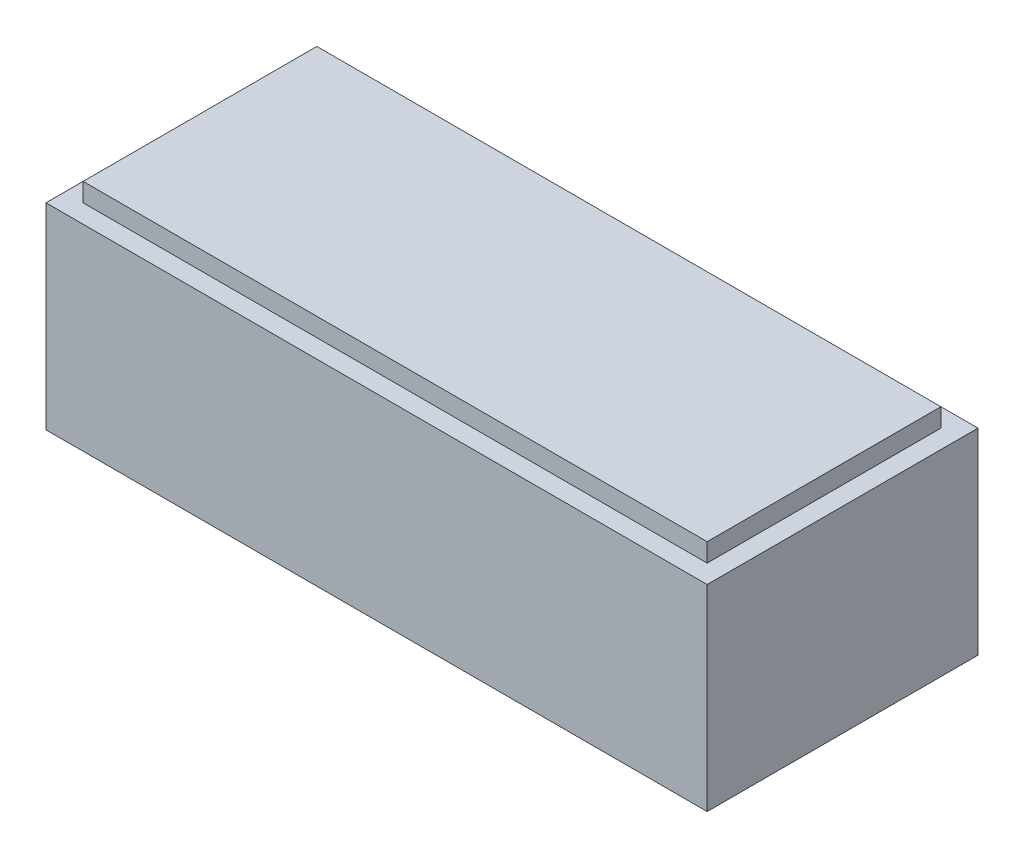
ISO-10303-21;
HEADER;
FILE_DESCRIPTION(('STEP AP214'),'2;1');
FILE_NAME('part.step','',(''),(''),'','','');
FILE_SCHEMA(('AUTOMOTIVE_DESIGN { 1 0 10303 214 1 1 1 1 }'));
ENDSEC;
DATA;
#1=APPLICATION_CONTEXT('core data for automotive mechanical design processes');
#2=APPLICATION_PROTOCOL_DEFINITION('international standard','automotive_design',2000,#1);
#3=PRODUCT_CONTEXT('',#1,'mechanical');
#4=PRODUCT('Part','Part','',(#3));
#5=PRODUCT_RELATED_PRODUCT_CATEGORY('part','',(#4));
#6=PRODUCT_DEFINITION_FORMATION('','',#4);
#7=PRODUCT_DEFINITION_CONTEXT('part definition',#1,'design');
#8=PRODUCT_DEFINITION('design','',#6,#7);
#9=PRODUCT_DEFINITION_SHAPE('','',#8);
#10=(LENGTH_UNIT() NAMED_UNIT(*) SI_UNIT(.MILLI.,.METRE.));
#11=(NAMED_UNIT(*) PLANE_ANGLE_UNIT() SI_UNIT($,.RADIAN.));
#12=(NAMED_UNIT(*) SI_UNIT($,.STERADIAN.) SOLID_ANGLE_UNIT());
#13=UNCERTAINTY_MEASURE_WITH_UNIT(LENGTH_MEASURE(1.E-05),#10,'distance_accuracy_value','');
#14=(GEOMETRIC_REPRESENTATION_CONTEXT(3) GLOBAL_UNCERTAINTY_ASSIGNED_CONTEXT((#13)) GLOBAL_UNIT_ASSIGNED_CONTEXT((#10,
#11,#12)) REPRESENTATION_CONTEXT('',''));
#15=CARTESIAN_POINT('',(0.,0.,0.));
#16=DIRECTION('',(0.,0.,1.));
#17=DIRECTION('',(1.,0.,0.));
#18=AXIS2_PLACEMENT_3D('',#15,#16,#17);
#19=CARTESIAN_POINT('',(0.,0.,0.));
#20=DIRECTION('',(0.,-1.,0.));
#21=DIRECTION('',(0.,0.,-1.));
#22=AXIS2_PLACEMENT_3D('',#19,#20,#21);
#23=PLANE('',#22);
#24=DIRECTION('',(0.,0.,1.));
#25=VECTOR('',#24,1.);
#26=CARTESIAN_POINT('',(0.,0.,0.));
#27=LINE('',#26,#25);
#28=CARTESIAN_POINT('',(0.,0.,-3.65));
#29=VERTEX_POINT('',#28);
#30=CARTESIAN_POINT('',(0.,0.,0.));
#31=VERTEX_POINT('',#30);
#32=EDGE_CURVE('E191',#29,#31,#27,.T.);
#33=ORIENTED_EDGE('',*,*,#32,.F.);
#34=DIRECTION('',(-1.,0.,0.));
#35=VECTOR('',#34,1.);
#36=CARTESIAN_POINT('',(0.,0.,-3.65));
#37=LINE('',#36,#35);
#38=CARTESIAN_POINT('',(8.91,0.,-3.65));
#39=VERTEX_POINT('',#38);
#40=EDGE_CURVE('E196',#39,#29,#37,.T.);
#41=ORIENTED_EDGE('',*,*,#40,.F.);
#42=DIRECTION('',(0.,0.,-1.));
#43=VECTOR('',#42,1.);
#44=CARTESIAN_POINT('',(8.91,0.,0.));
#45=LINE('',#44,#43);
#46=CARTESIAN_POINT('',(8.91,0.,0.));
#47=VERTEX_POINT('',#46);
#48=EDGE_CURVE('E207',#47,#39,#45,.T.);
#49=ORIENTED_EDGE('',*,*,#48,.F.);
#50=DIRECTION('',(1.,0.,0.));
#51=VECTOR('',#50,1.);
#52=CARTESIAN_POINT('',(0.,0.,0.));
#53=LINE('',#52,#51);
#54=EDGE_CURVE('E205',#31,#47,#53,.T.);
#55=ORIENTED_EDGE('',*,*,#54,.F.);
#56=EDGE_LOOP('',(#33,#41,#49,#55));
#57=FACE_BOUND('',#56,.T.);
#58=DIRECTION('',(1.,0.,0.));
#59=VECTOR('',#58,1.);
#60=CARTESIAN_POINT('',(0.,0.,-0.975000000000002));
#61=LINE('',#60,#59);
#62=CARTESIAN_POINT('',(2.5,0.,-0.975000000000001));
#63=VERTEX_POINT('',#62);
#64=CARTESIAN_POINT('',(6.41,0.,-0.975000000000001));
#65=VERTEX_POINT('',#64);
#66=EDGE_CURVE('E152',#63,#65,#61,.T.);
#67=ORIENTED_EDGE('',*,*,#66,.T.);
#68=DIRECTION('',(0.,0.,-1.));
#69=VECTOR('',#68,1.);
#70=CARTESIAN_POINT('',(6.41,0.,0.));
#71=LINE('',#70,#69);
#72=CARTESIAN_POINT('',(6.41,0.,-2.675));
#73=VERTEX_POINT('',#72);
#74=EDGE_CURVE('E49',#65,#73,#71,.T.);
#75=ORIENTED_EDGE('',*,*,#74,.T.);
#76=DIRECTION('',(1.,0.,0.));
#77=VECTOR('',#76,1.);
#78=CARTESIAN_POINT('',(0.,0.,-2.675));
#79=LINE('',#78,#77);
#80=CARTESIAN_POINT('',(2.5,0.,-2.675));
#81=VERTEX_POINT('',#80);
#82=EDGE_CURVE('E143',#81,#73,#79,.T.);
#83=ORIENTED_EDGE('',*,*,#82,.F.);
#84=DIRECTION('',(0.,0.,-1.));
#85=VECTOR('',#84,1.);
#86=CARTESIAN_POINT('',(2.5,0.,0.));
#87=LINE('',#86,#85);
#88=EDGE_CURVE('E146',#63,#81,#87,.T.);
#89=ORIENTED_EDGE('',*,*,#88,.F.);
#90=EDGE_LOOP('',(#67,#75,#83,#89));
#91=FACE_BOUND('',#90,.T.);
#92=ADVANCED_FACE('F34',(#57,#91),#23,.T.);
#93=CARTESIAN_POINT('',(0.,2.65,0.));
#94=DIRECTION('',(0.,-1.,0.));
#95=DIRECTION('',(0.,0.,-1.));
#96=AXIS2_PLACEMENT_3D('',#93,#94,#95);
#97=PLANE('',#96);
#98=DIRECTION('',(0.,0.,1.));
#99=VECTOR('',#98,1.);
#100=CARTESIAN_POINT('',(0.,2.65,0.));
#101=LINE('',#100,#99);
#102=CARTESIAN_POINT('',(0.,2.65,-3.65));
#103=VERTEX_POINT('',#102);
#104=CARTESIAN_POINT('',(0.,2.65,0.));
#105=VERTEX_POINT('',#104);
#106=EDGE_CURVE('E192',#103,#105,#101,.T.);
#107=ORIENTED_EDGE('',*,*,#106,.T.);
#108=DIRECTION('',(1.,0.,0.));
#109=VECTOR('',#108,1.);
#110=CARTESIAN_POINT('',(0.,2.65,0.));
#111=LINE('',#110,#109);
#112=CARTESIAN_POINT('',(8.91,2.65,0.));
#113=VERTEX_POINT('',#112);
#114=EDGE_CURVE('E195',#105,#113,#111,.T.);
#115=ORIENTED_EDGE('',*,*,#114,.T.);
#116=DIRECTION('',(0.,0.,-1.));
#117=VECTOR('',#116,1.);
#118=CARTESIAN_POINT('',(8.91,2.65,0.));
#119=LINE('',#118,#117);
#120=CARTESIAN_POINT('',(8.91,2.65,-3.65));
#121=VERTEX_POINT('',#120);
#122=EDGE_CURVE('E198',#113,#121,#119,.T.);
#123=ORIENTED_EDGE('',*,*,#122,.T.);
#124=DIRECTION('',(-1.,0.,0.));
#125=VECTOR('',#124,1.);
#126=CARTESIAN_POINT('',(0.,2.65,-3.65));
#127=LINE('',#126,#125);
#128=EDGE_CURVE('E200',#121,#103,#127,.T.);
#129=ORIENTED_EDGE('',*,*,#128,.T.);
#130=EDGE_LOOP('',(#107,#115,#123,#129));
#131=FACE_BOUND('',#130,.T.);
#132=DIRECTION('',(0.,0.,1.));
#133=VECTOR('',#132,1.);
#134=CARTESIAN_POINT('',(0.25,2.65,-0.25));
#135=LINE('',#134,#133);
#136=CARTESIAN_POINT('',(0.25,2.65,-3.4));
#137=VERTEX_POINT('',#136);
#138=CARTESIAN_POINT('',(0.25,2.65,-0.25));
#139=VERTEX_POINT('',#138);
#140=EDGE_CURVE('E158',#137,#139,#135,.T.);
#141=ORIENTED_EDGE('',*,*,#140,.F.);
#142=DIRECTION('',(-1.,0.,0.));
#143=VECTOR('',#142,1.);
#144=CARTESIAN_POINT('',(0.25,2.65,-3.4));
#145=LINE('',#144,#143);
#146=CARTESIAN_POINT('',(8.66,2.65,-3.4));
#147=VERTEX_POINT('',#146);
#148=EDGE_CURVE('E166',#147,#137,#145,.T.);
#149=ORIENTED_EDGE('',*,*,#148,.F.);
#150=DIRECTION('',(0.,0.,-1.));
#151=VECTOR('',#150,1.);
#152=CARTESIAN_POINT('',(8.66,2.65,-0.25));
#153=LINE('',#152,#151);
#154=CARTESIAN_POINT('',(8.66,2.65,-0.25));
#155=VERTEX_POINT('',#154);
#156=EDGE_CURVE('E176',#155,#147,#153,.T.);
#157=ORIENTED_EDGE('',*,*,#156,.F.);
#158=DIRECTION('',(1.,0.,0.));
#159=VECTOR('',#158,1.);
#160=CARTESIAN_POINT('',(0.25,2.65,-0.25));
#161=LINE('',#160,#159);
#162=EDGE_CURVE('E57',#139,#155,#161,.T.);
#163=ORIENTED_EDGE('',*,*,#162,.F.);
#164=EDGE_LOOP('',(#141,#149,#157,#163));
#165=FACE_BOUND('',#164,.T.);
#166=ADVANCED_FACE('F234',(#131,#165),#97,.F.);
#167=CARTESIAN_POINT('',(0.,2.65,0.));
#168=DIRECTION('',(1.,0.,0.));
#169=DIRECTION('',(0.,0.,-1.));
#170=AXIS2_PLACEMENT_3D('',#167,#168,#169);
#171=PLANE('',#170);
#172=ORIENTED_EDGE('',*,*,#32,.T.);
#173=DIRECTION('',(0.,-1.,0.));
#174=VECTOR('',#173,1.);
#175=CARTESIAN_POINT('',(0.,2.65,0.));
#176=LINE('',#175,#174);
#177=EDGE_CURVE('E11',#105,#31,#176,.T.);
#178=ORIENTED_EDGE('',*,*,#177,.F.);
#179=ORIENTED_EDGE('',*,*,#106,.F.);
#180=DIRECTION('',(0.,-1.,0.));
#181=VECTOR('',#180,1.);
#182=CARTESIAN_POINT('',(0.,2.65,-3.65));
#183=LINE('',#182,#181);
#184=EDGE_CURVE('E202',#103,#29,#183,.T.);
#185=ORIENTED_EDGE('',*,*,#184,.T.);
#186=EDGE_LOOP('',(#172,#178,#179,#185));
#187=FACE_BOUND('',#186,.T.);
#188=ADVANCED_FACE('F36',(#187),#171,.F.);
#189=CARTESIAN_POINT('',(0.,2.65,0.));
#190=DIRECTION('',(0.,0.,-1.));
#191=DIRECTION('',(-1.,0.,0.));
#192=AXIS2_PLACEMENT_3D('',#189,#190,#191);
#193=PLANE('',#192);
#194=ORIENTED_EDGE('',*,*,#54,.T.);
#195=DIRECTION('',(0.,-1.,0.));
#196=VECTOR('',#195,1.);
#197=CARTESIAN_POINT('',(8.91,2.65,0.));
#198=LINE('',#197,#196);
#199=EDGE_CURVE('E42',#113,#47,#198,.T.);
#200=ORIENTED_EDGE('',*,*,#199,.F.);
#201=ORIENTED_EDGE('',*,*,#114,.F.);
#202=ORIENTED_EDGE('',*,*,#177,.T.);
#203=EDGE_LOOP('',(#194,#200,#201,#202));
#204=FACE_BOUND('',#203,.T.);
#205=ADVANCED_FACE('F235',(#204),#193,.F.);
#206=CARTESIAN_POINT('',(8.91,2.65,0.));
#207=DIRECTION('',(-1.,0.,0.));
#208=DIRECTION('',(0.,0.,1.));
#209=AXIS2_PLACEMENT_3D('',#206,#207,#208);
#210=PLANE('',#209);
#211=ORIENTED_EDGE('',*,*,#48,.T.);
#212=DIRECTION('',(0.,-1.,0.));
#213=VECTOR('',#212,1.);
#214=CARTESIAN_POINT('',(8.91,2.65,-3.65));
#215=LINE('',#214,#213);
#216=EDGE_CURVE('E212',#121,#39,#215,.T.);
#217=ORIENTED_EDGE('',*,*,#216,.F.);
#218=ORIENTED_EDGE('',*,*,#122,.F.);
#219=ORIENTED_EDGE('',*,*,#199,.T.);
#220=EDGE_LOOP('',(#211,#217,#218,#219));
#221=FACE_BOUND('',#220,.T.);
#222=ADVANCED_FACE('F219',(#221),#210,.F.);
#223=CARTESIAN_POINT('',(0.,2.65,-3.65));
#224=DIRECTION('',(0.,0.,1.));
#225=DIRECTION('',(1.,0.,0.));
#226=AXIS2_PLACEMENT_3D('',#223,#224,#225);
#227=PLANE('',#226);
#228=ORIENTED_EDGE('',*,*,#40,.T.);
#229=ORIENTED_EDGE('',*,*,#184,.F.);
#230=ORIENTED_EDGE('',*,*,#128,.F.);
#231=ORIENTED_EDGE('',*,*,#216,.T.);
#232=EDGE_LOOP('',(#228,#229,#230,#231));
#233=FACE_BOUND('',#232,.T.);
#234=ADVANCED_FACE('F228',(#233),#227,.F.);
#235=CARTESIAN_POINT('',(0.25,2.9,-0.25));
#236=DIRECTION('',(1.,0.,0.));
#237=DIRECTION('',(0.,0.,-1.));
#238=AXIS2_PLACEMENT_3D('',#235,#236,#237);
#239=PLANE('',#238);
#240=ORIENTED_EDGE('',*,*,#140,.T.);
#241=DIRECTION('',(0.,-1.,0.));
#242=VECTOR('',#241,1.);
#243=CARTESIAN_POINT('',(0.25,2.9,-0.25));
#244=LINE('',#243,#242);
#245=CARTESIAN_POINT('',(0.25,2.9,-0.25));
#246=VERTEX_POINT('',#245);
#247=EDGE_CURVE('E189',#246,#139,#244,.T.);
#248=ORIENTED_EDGE('',*,*,#247,.F.);
#249=DIRECTION('',(0.,0.,1.));
#250=VECTOR('',#249,1.);
#251=CARTESIAN_POINT('',(0.25,2.9,-0.25));
#252=LINE('',#251,#250);
#253=CARTESIAN_POINT('',(0.25,2.9,-3.4));
#254=VERTEX_POINT('',#253);
#255=EDGE_CURVE('E162',#254,#246,#252,.T.);
#256=ORIENTED_EDGE('',*,*,#255,.F.);
#257=DIRECTION('',(0.,-1.,0.));
#258=VECTOR('',#257,1.);
#259=CARTESIAN_POINT('',(0.25,2.9,-3.4));
#260=LINE('',#259,#258);
#261=EDGE_CURVE('E172',#254,#137,#260,.T.);
#262=ORIENTED_EDGE('',*,*,#261,.T.);
#263=EDGE_LOOP('',(#240,#248,#256,#262));
#264=FACE_BOUND('',#263,.T.);
#265=ADVANCED_FACE('F251',(#264),#239,.F.);
#266=CARTESIAN_POINT('',(0.25,2.9,-0.25));
#267=DIRECTION('',(0.,0.,-1.));
#268=DIRECTION('',(-1.,0.,0.));
#269=AXIS2_PLACEMENT_3D('',#266,#267,#268);
#270=PLANE('',#269);
#271=ORIENTED_EDGE('',*,*,#162,.T.);
#272=DIRECTION('',(0.,-1.,0.));
#273=VECTOR('',#272,1.);
#274=CARTESIAN_POINT('',(8.66,2.9,-0.25));
#275=LINE('',#274,#273);
#276=CARTESIAN_POINT('',(8.66,2.9,-0.25));
#277=VERTEX_POINT('',#276);
#278=EDGE_CURVE('E186',#277,#155,#275,.T.);
#279=ORIENTED_EDGE('',*,*,#278,.F.);
#280=DIRECTION('',(1.,0.,0.));
#281=VECTOR('',#280,1.);
#282=CARTESIAN_POINT('',(0.25,2.9,-0.25));
#283=LINE('',#282,#281);
#284=EDGE_CURVE('E165',#246,#277,#283,.T.);
#285=ORIENTED_EDGE('',*,*,#284,.F.);
#286=ORIENTED_EDGE('',*,*,#247,.T.);
#287=EDGE_LOOP('',(#271,#279,#285,#286));
#288=FACE_BOUND('',#287,.T.);
#289=ADVANCED_FACE('F255',(#288),#270,.F.);
#290=CARTESIAN_POINT('',(8.66,2.9,-0.25));
#291=DIRECTION('',(-1.,0.,0.));
#292=DIRECTION('',(0.,0.,1.));
#293=AXIS2_PLACEMENT_3D('',#290,#291,#292);
#294=PLANE('',#293);
#295=ORIENTED_EDGE('',*,*,#156,.T.);
#296=DIRECTION('',(0.,-1.,0.));
#297=VECTOR('',#296,1.);
#298=CARTESIAN_POINT('',(8.66,2.9,-3.4));
#299=LINE('',#298,#297);
#300=CARTESIAN_POINT('',(8.66,2.9,-3.4));
#301=VERTEX_POINT('',#300);
#302=EDGE_CURVE('E183',#301,#147,#299,.T.);
#303=ORIENTED_EDGE('',*,*,#302,.F.);
#304=DIRECTION('',(0.,0.,-1.));
#305=VECTOR('',#304,1.);
#306=CARTESIAN_POINT('',(8.66,2.9,-0.25));
#307=LINE('',#306,#305);
#308=EDGE_CURVE('E168',#277,#301,#307,.T.);
#309=ORIENTED_EDGE('',*,*,#308,.F.);
#310=ORIENTED_EDGE('',*,*,#278,.T.);
#311=EDGE_LOOP('',(#295,#303,#309,#310));
#312=FACE_BOUND('',#311,.T.);
#313=ADVANCED_FACE('F260',(#312),#294,.F.);
#314=CARTESIAN_POINT('',(0.25,2.9,-3.4));
#315=DIRECTION('',(0.,0.,1.));
#316=DIRECTION('',(1.,0.,0.));
#317=AXIS2_PLACEMENT_3D('',#314,#315,#316);
#318=PLANE('',#317);
#319=ORIENTED_EDGE('',*,*,#148,.T.);
#320=ORIENTED_EDGE('',*,*,#261,.F.);
#321=DIRECTION('',(-1.,0.,0.));
#322=VECTOR('',#321,1.);
#323=CARTESIAN_POINT('',(0.25,2.9,-3.4));
#324=LINE('',#323,#322);
#325=EDGE_CURVE('E170',#301,#254,#324,.T.);
#326=ORIENTED_EDGE('',*,*,#325,.F.);
#327=ORIENTED_EDGE('',*,*,#302,.T.);
#328=EDGE_LOOP('',(#319,#320,#326,#327));
#329=FACE_BOUND('',#328,.T.);
#330=ADVANCED_FACE('F266',(#329),#318,.F.);
#331=CARTESIAN_POINT('',(0.,2.9,0.));
#332=DIRECTION('',(0.,-1.,0.));
#333=DIRECTION('',(0.,0.,-1.));
#334=AXIS2_PLACEMENT_3D('',#331,#332,#333);
#335=PLANE('',#334);
#336=ORIENTED_EDGE('',*,*,#255,.T.);
#337=ORIENTED_EDGE('',*,*,#284,.T.);
#338=ORIENTED_EDGE('',*,*,#308,.T.);
#339=ORIENTED_EDGE('',*,*,#325,.T.);
#340=EDGE_LOOP('',(#336,#337,#338,#339));
#341=FACE_BOUND('',#340,.T.);
#342=ADVANCED_FACE('F270',(#341),#335,.F.);
#343=CARTESIAN_POINT('',(6.41,0.5,0.));
#344=DIRECTION('',(-1.,0.,0.));
#345=DIRECTION('',(0.,0.,1.));
#346=AXIS2_PLACEMENT_3D('',#343,#344,#345);
#347=PLANE('',#346);
#348=ORIENTED_EDGE('',*,*,#74,.F.);
#349=DIRECTION('',(0.,-1.,0.));
#350=VECTOR('',#349,1.);
#351=CARTESIAN_POINT('',(6.41,0.5,-0.975000000000001));
#352=LINE('',#351,#350);
#353=CARTESIAN_POINT('',(6.41,0.5,-0.975000000000001));
#354=VERTEX_POINT('',#353);
#355=EDGE_CURVE('E126',#354,#65,#352,.T.);
#356=ORIENTED_EDGE('',*,*,#355,.F.);
#357=DIRECTION('',(0.,0.,-1.));
#358=VECTOR('',#357,1.);
#359=CARTESIAN_POINT('',(6.41,0.5,0.));
#360=LINE('',#359,#358);
#361=CARTESIAN_POINT('',(6.41,0.5,-2.675));
#362=VERTEX_POINT('',#361);
#363=EDGE_CURVE('E134',#354,#362,#360,.T.);
#364=ORIENTED_EDGE('',*,*,#363,.T.);
#365=DIRECTION('',(0.,-1.,0.));
#366=VECTOR('',#365,1.);
#367=CARTESIAN_POINT('',(6.41,0.5,-2.675));
#368=LINE('',#367,#366);
#369=EDGE_CURVE('E156',#362,#73,#368,.T.);
#370=ORIENTED_EDGE('',*,*,#369,.T.);
#371=EDGE_LOOP('',(#348,#356,#364,#370));
#372=FACE_BOUND('',#371,.T.);
#373=ADVANCED_FACE('F136',(#372),#347,.T.);
#374=CARTESIAN_POINT('',(0.,0.5,-2.675));
#375=DIRECTION('',(0.,0.,-1.));
#376=DIRECTION('',(-1.,0.,0.));
#377=AXIS2_PLACEMENT_3D('',#374,#375,#376);
#378=PLANE('',#377);
#379=ORIENTED_EDGE('',*,*,#82,.T.);
#380=ORIENTED_EDGE('',*,*,#369,.F.);
#381=DIRECTION('',(1.,0.,0.));
#382=VECTOR('',#381,1.);
#383=CARTESIAN_POINT('',(0.,0.5,-2.675));
#384=LINE('',#383,#382);
#385=CARTESIAN_POINT('',(2.5,0.5,-2.675));
#386=VERTEX_POINT('',#385);
#387=EDGE_CURVE('E138',#386,#362,#384,.T.);
#388=ORIENTED_EDGE('',*,*,#387,.F.);
#389=DIRECTION('',(0.,-1.,0.));
#390=VECTOR('',#389,1.);
#391=CARTESIAN_POINT('',(2.5,0.5,-2.675));
#392=LINE('',#391,#390);
#393=EDGE_CURVE('E159',#386,#81,#392,.T.);
#394=ORIENTED_EDGE('',*,*,#393,.T.);
#395=EDGE_LOOP('',(#379,#380,#388,#394));
#396=FACE_BOUND('',#395,.T.);
#397=ADVANCED_FACE('F277',(#396),#378,.F.);
#398=CARTESIAN_POINT('',(2.5,0.5,0.));
#399=DIRECTION('',(-1.,0.,0.));
#400=DIRECTION('',(0.,0.,1.));
#401=AXIS2_PLACEMENT_3D('',#398,#399,#400);
#402=PLANE('',#401);
#403=ORIENTED_EDGE('',*,*,#88,.T.);
#404=ORIENTED_EDGE('',*,*,#393,.F.);
#405=DIRECTION('',(0.,0.,-1.));
#406=VECTOR('',#405,1.);
#407=CARTESIAN_POINT('',(2.5,0.5,0.));
#408=LINE('',#407,#406);
#409=CARTESIAN_POINT('',(2.5,0.5,-0.975000000000001));
#410=VERTEX_POINT('',#409);
#411=EDGE_CURVE('E133',#410,#386,#408,.T.);
#412=ORIENTED_EDGE('',*,*,#411,.F.);
#413=DIRECTION('',(0.,-1.,0.));
#414=VECTOR('',#413,1.);
#415=CARTESIAN_POINT('',(2.5,0.5,-0.975000000000001));
#416=LINE('',#415,#414);
#417=EDGE_CURVE('E128',#410,#63,#416,.T.);
#418=ORIENTED_EDGE('',*,*,#417,.T.);
#419=EDGE_LOOP('',(#403,#404,#412,#418));
#420=FACE_BOUND('',#419,.T.);
#421=ADVANCED_FACE('F280',(#420),#402,.F.);
#422=CARTESIAN_POINT('',(0.,0.5,-0.975000000000002));
#423=DIRECTION('',(0.,0.,-1.));
#424=DIRECTION('',(-1.,0.,0.));
#425=AXIS2_PLACEMENT_3D('',#422,#423,#424);
#426=PLANE('',#425);
#427=ORIENTED_EDGE('',*,*,#66,.F.);
#428=ORIENTED_EDGE('',*,*,#417,.F.);
#429=DIRECTION('',(1.,0.,0.));
#430=VECTOR('',#429,1.);
#431=CARTESIAN_POINT('',(0.,0.5,-0.975000000000002));
#432=LINE('',#431,#430);
#433=EDGE_CURVE('E123',#410,#354,#432,.T.);
#434=ORIENTED_EDGE('',*,*,#433,.T.);
#435=ORIENTED_EDGE('',*,*,#355,.T.);
#436=EDGE_LOOP('',(#427,#428,#434,#435));
#437=FACE_BOUND('',#436,.T.);
#438=ADVANCED_FACE('F125',(#437),#426,.T.);
#439=CARTESIAN_POINT('',(0.,0.5,0.));
#440=DIRECTION('',(0.,-1.,0.));
#441=DIRECTION('',(0.,0.,-1.));
#442=AXIS2_PLACEMENT_3D('',#439,#440,#441);
#443=PLANE('',#442);
#444=ORIENTED_EDGE('',*,*,#363,.F.);
#445=ORIENTED_EDGE('',*,*,#433,.F.);
#446=ORIENTED_EDGE('',*,*,#411,.T.);
#447=ORIENTED_EDGE('',*,*,#387,.T.);
#448=EDGE_LOOP('',(#444,#445,#446,#447));
#449=FACE_BOUND('',#448,.T.);
#450=ADVANCED_FACE('F141',(#449),#443,.T.);
#451=CLOSED_SHELL('',(#92,#166,#188,#205,#222,#234,#265,#289,#313,#330,#342,#373,#397,#421,#438,#450));
#452=MANIFOLD_SOLID_BREP('B2',#451);
#453=ADVANCED_BREP_SHAPE_REPRESENTATION('',(#18,#452),#14);
#454=SHAPE_DEFINITION_REPRESENTATION(#9,#453);
ENDSEC;
END-ISO-10303-21;
